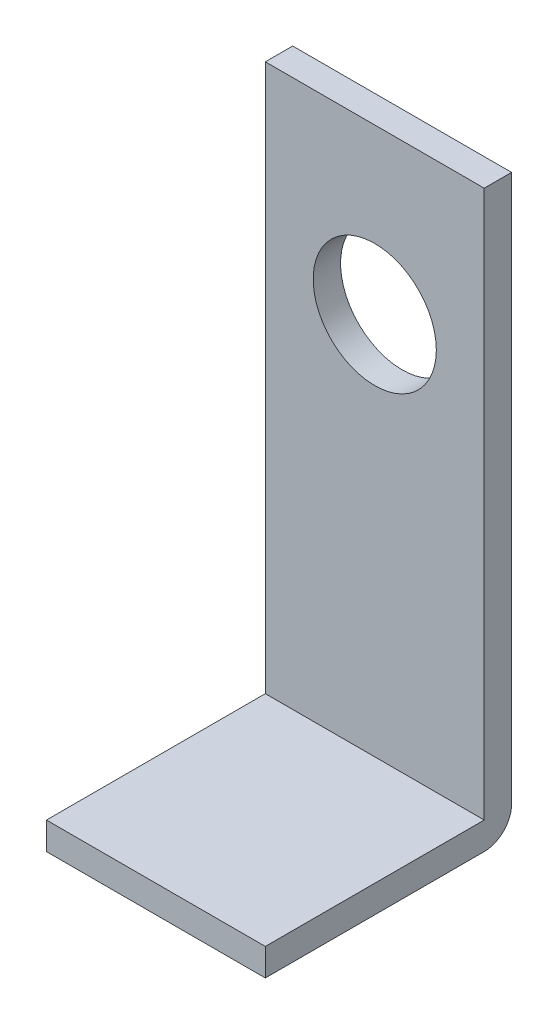
ISO-10303-21;
HEADER;
FILE_DESCRIPTION(('STEP AP214'),'2;1');
FILE_NAME('part.step','',(''),(''),'','','');
FILE_SCHEMA(('AUTOMOTIVE_DESIGN { 1 0 10303 214 1 1 1 1 }'));
ENDSEC;
DATA;
#1=APPLICATION_CONTEXT('core data for automotive mechanical design processes');
#2=APPLICATION_PROTOCOL_DEFINITION('international standard','automotive_design',2000,#1);
#3=PRODUCT_CONTEXT('',#1,'mechanical');
#4=PRODUCT('Part','Part','',(#3));
#5=PRODUCT_RELATED_PRODUCT_CATEGORY('part','',(#4));
#6=PRODUCT_DEFINITION_FORMATION('','',#4);
#7=PRODUCT_DEFINITION_CONTEXT('part definition',#1,'design');
#8=PRODUCT_DEFINITION('design','',#6,#7);
#9=PRODUCT_DEFINITION_SHAPE('','',#8);
#10=(LENGTH_UNIT() NAMED_UNIT(*) SI_UNIT(.MILLI.,.METRE.));
#11=(NAMED_UNIT(*) PLANE_ANGLE_UNIT() SI_UNIT($,.RADIAN.));
#12=(NAMED_UNIT(*) SI_UNIT($,.STERADIAN.) SOLID_ANGLE_UNIT());
#13=UNCERTAINTY_MEASURE_WITH_UNIT(LENGTH_MEASURE(1.E-05),#10,'distance_accuracy_value','');
#14=(GEOMETRIC_REPRESENTATION_CONTEXT(3) GLOBAL_UNCERTAINTY_ASSIGNED_CONTEXT((#13)) GLOBAL_UNIT_ASSIGNED_CONTEXT((#10,
#11,#12)) REPRESENTATION_CONTEXT('',''));
#15=CARTESIAN_POINT('',(0.,0.,0.));
#16=DIRECTION('',(0.,0.,1.));
#17=DIRECTION('',(1.,0.,0.));
#18=AXIS2_PLACEMENT_3D('',#15,#16,#17);
#19=CARTESIAN_POINT('',(12.7,-31.75,3.175));
#20=DIRECTION('',(-1.,0.,0.));
#21=DIRECTION('',(0.,0.,1.));
#22=AXIS2_PLACEMENT_3D('',#19,#20,#21);
#23=PLANE('',#22);
#24=DIRECTION('',(0.,1.,0.));
#25=VECTOR('',#24,1.);
#26=CARTESIAN_POINT('',(12.7,-31.75,0.));
#27=LINE('',#26,#25);
#28=CARTESIAN_POINT('',(12.7,-31.75,0.));
#29=VERTEX_POINT('',#28);
#30=CARTESIAN_POINT('',(12.7,31.75,0.));
#31=VERTEX_POINT('',#30);
#32=EDGE_CURVE('E74',#29,#31,#27,.T.);
#33=ORIENTED_EDGE('',*,*,#32,.T.);
#34=DIRECTION('',(0.,0.,-1.));
#35=VECTOR('',#34,1.);
#36=CARTESIAN_POINT('',(12.7,31.75,3.175));
#37=LINE('',#36,#35);
#38=CARTESIAN_POINT('',(12.7,31.75,3.175));
#39=VERTEX_POINT('',#38);
#40=EDGE_CURVE('E11',#39,#31,#37,.T.);
#41=ORIENTED_EDGE('',*,*,#40,.F.);
#42=DIRECTION('',(0.,1.,0.));
#43=VECTOR('',#42,1.);
#44=CARTESIAN_POINT('',(12.7,-31.75,3.175));
#45=LINE('',#44,#43);
#46=CARTESIAN_POINT('',(12.7,-31.75,3.175));
#47=VERTEX_POINT('',#46);
#48=EDGE_CURVE('E95',#47,#39,#45,.T.);
#49=ORIENTED_EDGE('',*,*,#48,.F.);
#50=DIRECTION('',(0.,0.,1.));
#51=VECTOR('',#50,1.);
#52=CARTESIAN_POINT('',(12.7,-31.75,3.175));
#53=LINE('',#52,#51);
#54=CARTESIAN_POINT('',(12.7,-31.75,28.575));
#55=VERTEX_POINT('',#54);
#56=EDGE_CURVE('E49',#47,#55,#53,.T.);
#57=ORIENTED_EDGE('',*,*,#56,.T.);
#58=DIRECTION('',(0.,-1.,0.));
#59=VECTOR('',#58,1.);
#60=CARTESIAN_POINT('',(12.7,-31.75,28.575));
#61=LINE('',#60,#59);
#62=CARTESIAN_POINT('',(12.7,-34.925,28.575));
#63=VERTEX_POINT('',#62);
#64=EDGE_CURVE('E148',#55,#63,#61,.T.);
#65=ORIENTED_EDGE('',*,*,#64,.T.);
#66=DIRECTION('',(0.,0.,-1.));
#67=VECTOR('',#66,1.);
#68=CARTESIAN_POINT('',(12.7,-34.925,3.175));
#69=LINE('',#68,#67);
#70=CARTESIAN_POINT('',(12.7,-34.925,3.175));
#71=VERTEX_POINT('',#70);
#72=EDGE_CURVE('E101',#63,#71,#69,.T.);
#73=ORIENTED_EDGE('',*,*,#72,.T.);
#74=CARTESIAN_POINT('',(12.7,-31.75,3.175));
#75=DIRECTION('',(1.,0.,0.));
#76=DIRECTION('',(0.,0.,-1.));
#77=AXIS2_PLACEMENT_3D('',#74,#75,#76);
#78=CIRCLE('',#77,3.17499999999999);
#79=EDGE_CURVE('E92',#71,#29,#78,.T.);
#80=ORIENTED_EDGE('',*,*,#79,.T.);
#81=EDGE_LOOP('',(#33,#41,#49,#57,#65,#73,#80));
#82=FACE_BOUND('',#81,.T.);
#83=ADVANCED_FACE('F33',(#82),#23,.F.);
#84=CARTESIAN_POINT('',(-12.7,31.75,3.175));
#85=DIRECTION('',(0.,-1.,0.));
#86=DIRECTION('',(0.,0.,-1.));
#87=AXIS2_PLACEMENT_3D('',#84,#85,#86);
#88=PLANE('',#87);
#89=DIRECTION('',(-1.,0.,0.));
#90=VECTOR('',#89,1.);
#91=CARTESIAN_POINT('',(-12.7,31.75,0.));
#92=LINE('',#91,#90);
#93=CARTESIAN_POINT('',(-12.7,31.75,0.));
#94=VERTEX_POINT('',#93);
#95=EDGE_CURVE('E80',#31,#94,#92,.T.);
#96=ORIENTED_EDGE('',*,*,#95,.T.);
#97=DIRECTION('',(0.,0.,-1.));
#98=VECTOR('',#97,1.);
#99=CARTESIAN_POINT('',(-12.7,31.75,3.175));
#100=LINE('',#99,#98);
#101=CARTESIAN_POINT('',(-12.7,31.75,3.175));
#102=VERTEX_POINT('',#101);
#103=EDGE_CURVE('E41',#102,#94,#100,.T.);
#104=ORIENTED_EDGE('',*,*,#103,.F.);
#105=DIRECTION('',(-1.,0.,0.));
#106=VECTOR('',#105,1.);
#107=CARTESIAN_POINT('',(-12.7,31.75,3.175));
#108=LINE('',#107,#106);
#109=EDGE_CURVE('E58',#39,#102,#108,.T.);
#110=ORIENTED_EDGE('',*,*,#109,.F.);
#111=ORIENTED_EDGE('',*,*,#40,.T.);
#112=EDGE_LOOP('',(#96,#104,#110,#111));
#113=FACE_BOUND('',#112,.T.);
#114=ADVANCED_FACE('F130',(#113),#88,.F.);
#115=CARTESIAN_POINT('',(-12.7,-31.75,3.175));
#116=DIRECTION('',(1.,0.,0.));
#117=DIRECTION('',(0.,0.,-1.));
#118=AXIS2_PLACEMENT_3D('',#115,#116,#117);
#119=PLANE('',#118);
#120=DIRECTION('',(0.,-1.,0.));
#121=VECTOR('',#120,1.);
#122=CARTESIAN_POINT('',(-12.7,-31.75,0.));
#123=LINE('',#122,#121);
#124=CARTESIAN_POINT('',(-12.7,-31.75,0.));
#125=VERTEX_POINT('',#124);
#126=EDGE_CURVE('E96',#94,#125,#123,.T.);
#127=ORIENTED_EDGE('',*,*,#126,.T.);
#128=CARTESIAN_POINT('',(-12.7,-31.75,3.175));
#129=DIRECTION('',(1.,0.,0.));
#130=DIRECTION('',(0.,0.,-1.));
#131=AXIS2_PLACEMENT_3D('',#128,#129,#130);
#132=CIRCLE('',#131,3.17499999999999);
#133=CARTESIAN_POINT('',(-12.7,-34.925,3.175));
#134=VERTEX_POINT('',#133);
#135=EDGE_CURVE('E94',#134,#125,#132,.T.);
#136=ORIENTED_EDGE('',*,*,#135,.F.);
#137=DIRECTION('',(0.,0.,-1.));
#138=VECTOR('',#137,1.);
#139=CARTESIAN_POINT('',(-12.7,-34.925,3.175));
#140=LINE('',#139,#138);
#141=CARTESIAN_POINT('',(-12.7,-34.925,28.575));
#142=VERTEX_POINT('',#141);
#143=EDGE_CURVE('E137',#142,#134,#140,.T.);
#144=ORIENTED_EDGE('',*,*,#143,.F.);
#145=DIRECTION('',(0.,-1.,0.));
#146=VECTOR('',#145,1.);
#147=CARTESIAN_POINT('',(-12.7,-31.75,28.575));
#148=LINE('',#147,#146);
#149=CARTESIAN_POINT('',(-12.7,-31.75,28.575));
#150=VERTEX_POINT('',#149);
#151=EDGE_CURVE('E141',#150,#142,#148,.T.);
#152=ORIENTED_EDGE('',*,*,#151,.F.);
#153=DIRECTION('',(0.,0.,1.));
#154=VECTOR('',#153,1.);
#155=CARTESIAN_POINT('',(-12.7,-31.75,3.175));
#156=LINE('',#155,#154);
#157=CARTESIAN_POINT('',(-12.7,-31.75,3.175));
#158=VERTEX_POINT('',#157);
#159=EDGE_CURVE('E144',#158,#150,#156,.T.);
#160=ORIENTED_EDGE('',*,*,#159,.F.);
#161=DIRECTION('',(0.,-1.,0.));
#162=VECTOR('',#161,1.);
#163=CARTESIAN_POINT('',(-12.7,-31.75,3.175));
#164=LINE('',#163,#162);
#165=EDGE_CURVE('E118',#102,#158,#164,.T.);
#166=ORIENTED_EDGE('',*,*,#165,.F.);
#167=ORIENTED_EDGE('',*,*,#103,.T.);
#168=EDGE_LOOP('',(#127,#136,#144,#152,#160,#166,#167));
#169=FACE_BOUND('',#168,.T.);
#170=ADVANCED_FACE('F127',(#169),#119,.F.);
#171=CARTESIAN_POINT('',(12.7,31.75,3.175));
#172=DIRECTION('',(0.,0.,-1.));
#173=DIRECTION('',(-1.,0.,0.));
#174=AXIS2_PLACEMENT_3D('',#171,#172,#173);
#175=PLANE('',#174);
#176=CARTESIAN_POINT('',(0.,12.7,3.175));
#177=DIRECTION('',(0.,0.,1.));
#178=DIRECTION('',(1.,0.,0.));
#179=AXIS2_PLACEMENT_3D('',#176,#177,#178);
#180=CIRCLE('',#179,7.14375);
#181=CARTESIAN_POINT('',(7.14375,12.7,3.175));
#182=VERTEX_POINT('',#181);
#183=EDGE_CURVE('E152',#182,#182,#180,.T.);
#184=ORIENTED_EDGE('',*,*,#183,.F.);
#185=EDGE_LOOP('',(#184));
#186=FACE_BOUND('',#185,.T.);
#187=ORIENTED_EDGE('',*,*,#165,.T.);
#188=DIRECTION('',(1.,0.,0.));
#189=VECTOR('',#188,1.);
#190=CARTESIAN_POINT('',(-12.7,-31.75,3.175));
#191=LINE('',#190,#189);
#192=EDGE_CURVE('E134',#158,#47,#191,.T.);
#193=ORIENTED_EDGE('',*,*,#192,.T.);
#194=ORIENTED_EDGE('',*,*,#48,.T.);
#195=ORIENTED_EDGE('',*,*,#109,.T.);
#196=EDGE_LOOP('',(#187,#193,#194,#195));
#197=FACE_BOUND('',#196,.T.);
#198=ADVANCED_FACE('F133',(#186,#197),#175,.F.);
#199=CARTESIAN_POINT('',(12.7,31.75,0.));
#200=DIRECTION('',(0.,0.,-1.));
#201=DIRECTION('',(-1.,0.,0.));
#202=AXIS2_PLACEMENT_3D('',#199,#200,#201);
#203=PLANE('',#202);
#204=CARTESIAN_POINT('',(0.,12.7,0.));
#205=DIRECTION('',(0.,0.,1.));
#206=DIRECTION('',(1.,0.,0.));
#207=AXIS2_PLACEMENT_3D('',#204,#205,#206);
#208=CIRCLE('',#207,7.14375);
#209=CARTESIAN_POINT('',(7.14375,12.7,0.));
#210=VERTEX_POINT('',#209);
#211=EDGE_CURVE('E155',#210,#210,#208,.T.);
#212=ORIENTED_EDGE('',*,*,#211,.T.);
#213=EDGE_LOOP('',(#212));
#214=FACE_BOUND('',#213,.T.);
#215=ORIENTED_EDGE('',*,*,#32,.F.);
#216=DIRECTION('',(1.,0.,0.));
#217=VECTOR('',#216,1.);
#218=CARTESIAN_POINT('',(-12.7,-31.75,0.));
#219=LINE('',#218,#217);
#220=EDGE_CURVE('E78',#125,#29,#219,.T.);
#221=ORIENTED_EDGE('',*,*,#220,.F.);
#222=ORIENTED_EDGE('',*,*,#126,.F.);
#223=ORIENTED_EDGE('',*,*,#95,.F.);
#224=EDGE_LOOP('',(#215,#221,#222,#223));
#225=FACE_BOUND('',#224,.T.);
#226=ADVANCED_FACE('F76',(#214,#225),#203,.T.);
#227=CARTESIAN_POINT('',(-12.7,-31.75,3.175));
#228=DIRECTION('',(1.,0.,0.));
#229=DIRECTION('',(0.,0.,-1.));
#230=AXIS2_PLACEMENT_3D('',#227,#228,#229);
#231=CYLINDRICAL_SURFACE('',#230,3.17499999999999);
#232=ORIENTED_EDGE('',*,*,#79,.F.);
#233=DIRECTION('',(1.,0.,0.));
#234=VECTOR('',#233,1.);
#235=CARTESIAN_POINT('',(-12.7,-34.925,3.175));
#236=LINE('',#235,#234);
#237=EDGE_CURVE('E84',#134,#71,#236,.T.);
#238=ORIENTED_EDGE('',*,*,#237,.F.);
#239=ORIENTED_EDGE('',*,*,#135,.T.);
#240=ORIENTED_EDGE('',*,*,#220,.T.);
#241=EDGE_LOOP('',(#232,#238,#239,#240));
#242=FACE_BOUND('',#241,.T.);
#243=ADVANCED_FACE('F89',(#242),#231,.T.);
#244=CARTESIAN_POINT('',(-12.7,-34.925,3.175));
#245=DIRECTION('',(0.,-1.,0.));
#246=DIRECTION('',(0.,0.,-1.));
#247=AXIS2_PLACEMENT_3D('',#244,#245,#246);
#248=PLANE('',#247);
#249=ORIENTED_EDGE('',*,*,#72,.F.);
#250=DIRECTION('',(1.,0.,0.));
#251=VECTOR('',#250,1.);
#252=CARTESIAN_POINT('',(-12.7,-34.925,28.575));
#253=LINE('',#252,#251);
#254=EDGE_CURVE('E102',#142,#63,#253,.T.);
#255=ORIENTED_EDGE('',*,*,#254,.F.);
#256=ORIENTED_EDGE('',*,*,#143,.T.);
#257=ORIENTED_EDGE('',*,*,#237,.T.);
#258=EDGE_LOOP('',(#249,#255,#256,#257));
#259=FACE_BOUND('',#258,.T.);
#260=ADVANCED_FACE('F199',(#259),#248,.T.);
#261=CARTESIAN_POINT('',(-12.7,-31.75,28.575));
#262=DIRECTION('',(0.,0.,1.));
#263=DIRECTION('',(1.,0.,0.));
#264=AXIS2_PLACEMENT_3D('',#261,#262,#263);
#265=PLANE('',#264);
#266=ORIENTED_EDGE('',*,*,#64,.F.);
#267=DIRECTION('',(1.,0.,0.));
#268=VECTOR('',#267,1.);
#269=CARTESIAN_POINT('',(-12.7,-31.75,28.575));
#270=LINE('',#269,#268);
#271=EDGE_CURVE('E106',#150,#55,#270,.T.);
#272=ORIENTED_EDGE('',*,*,#271,.F.);
#273=ORIENTED_EDGE('',*,*,#151,.T.);
#274=ORIENTED_EDGE('',*,*,#254,.T.);
#275=EDGE_LOOP('',(#266,#272,#273,#274));
#276=FACE_BOUND('',#275,.T.);
#277=ADVANCED_FACE('F208',(#276),#265,.T.);
#278=CARTESIAN_POINT('',(-12.7,-31.75,3.175));
#279=DIRECTION('',(0.,1.,0.));
#280=DIRECTION('',(0.,0.,1.));
#281=AXIS2_PLACEMENT_3D('',#278,#279,#280);
#282=PLANE('',#281);
#283=ORIENTED_EDGE('',*,*,#56,.F.);
#284=ORIENTED_EDGE('',*,*,#192,.F.);
#285=ORIENTED_EDGE('',*,*,#159,.T.);
#286=ORIENTED_EDGE('',*,*,#271,.T.);
#287=EDGE_LOOP('',(#283,#284,#285,#286));
#288=FACE_BOUND('',#287,.T.);
#289=ADVANCED_FACE('F163',(#288),#282,.T.);
#290=CARTESIAN_POINT('',(0.,12.7,0.));
#291=DIRECTION('',(0.,0.,1.));
#292=DIRECTION('',(1.,0.,0.));
#293=AXIS2_PLACEMENT_3D('',#290,#291,#292);
#294=CYLINDRICAL_SURFACE('',#293,7.14375);
#295=ORIENTED_EDGE('',*,*,#211,.F.);
#296=EDGE_LOOP('',(#295));
#297=FACE_BOUND('',#296,.T.);
#298=ORIENTED_EDGE('',*,*,#183,.T.);
#299=EDGE_LOOP('',(#298));
#300=FACE_BOUND('',#299,.T.);
#301=ADVANCED_FACE('F160',(#297,#300),#294,.F.);
#302=CLOSED_SHELL('',(#83,#114,#170,#198,#226,#243,#260,#277,#289,#301));
#303=MANIFOLD_SOLID_BREP('B2',#302);
#304=ADVANCED_BREP_SHAPE_REPRESENTATION('',(#18,#303),#14);
#305=SHAPE_DEFINITION_REPRESENTATION(#9,#304);
ENDSEC;
END-ISO-10303-21;
